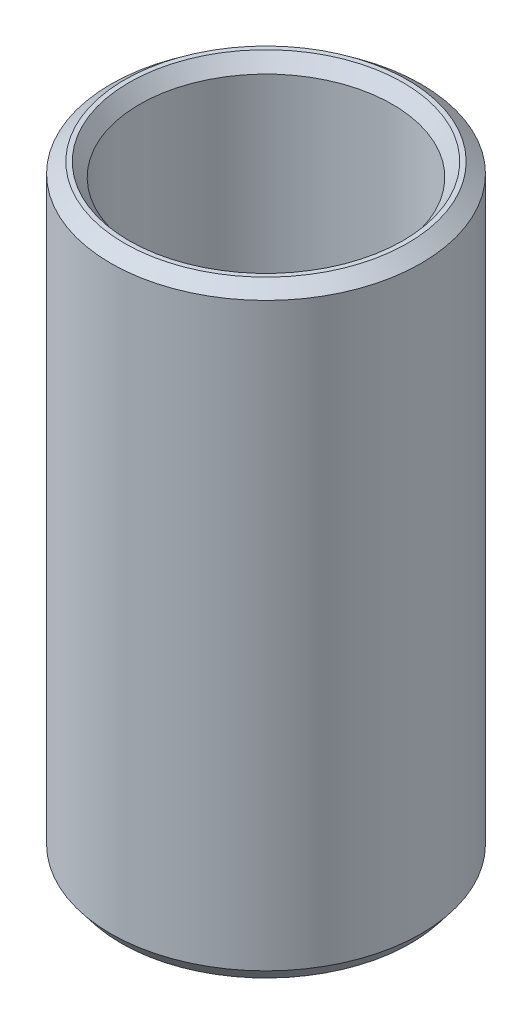
ISO-10303-21;
HEADER;
FILE_DESCRIPTION(('STEP AP214'),'2;1');
FILE_NAME('part.step','',(''),(''),'','','');
FILE_SCHEMA(('AUTOMOTIVE_DESIGN { 1 0 10303 214 1 1 1 1 }'));
ENDSEC;
DATA;
#1=APPLICATION_CONTEXT('core data for automotive mechanical design processes');
#2=APPLICATION_PROTOCOL_DEFINITION('international standard','automotive_design',2000,#1);
#3=PRODUCT_CONTEXT('',#1,'mechanical');
#4=PRODUCT('Part','Part','',(#3));
#5=PRODUCT_RELATED_PRODUCT_CATEGORY('part','',(#4));
#6=PRODUCT_DEFINITION_FORMATION('','',#4);
#7=PRODUCT_DEFINITION_CONTEXT('part definition',#1,'design');
#8=PRODUCT_DEFINITION('design','',#6,#7);
#9=PRODUCT_DEFINITION_SHAPE('','',#8);
#10=(LENGTH_UNIT() NAMED_UNIT(*) SI_UNIT(.MILLI.,.METRE.));
#11=(NAMED_UNIT(*) PLANE_ANGLE_UNIT() SI_UNIT($,.RADIAN.));
#12=(NAMED_UNIT(*) SI_UNIT($,.STERADIAN.) SOLID_ANGLE_UNIT());
#13=UNCERTAINTY_MEASURE_WITH_UNIT(LENGTH_MEASURE(1.E-05),#10,'distance_accuracy_value','');
#14=(GEOMETRIC_REPRESENTATION_CONTEXT(3) GLOBAL_UNCERTAINTY_ASSIGNED_CONTEXT((#13)) GLOBAL_UNIT_ASSIGNED_CONTEXT((#10,
#11,#12)) REPRESENTATION_CONTEXT('',''));
#15=CARTESIAN_POINT('',(0.,0.,0.));
#16=DIRECTION('',(0.,0.,1.));
#17=DIRECTION('',(1.,0.,0.));
#18=AXIS2_PLACEMENT_3D('',#15,#16,#17);
#19=CARTESIAN_POINT('',(0.,175.367665250587,0.));
#20=DIRECTION('',(0.,-1.,0.));
#21=DIRECTION('',(0.,0.,-1.));
#22=AXIS2_PLACEMENT_3D('',#19,#20,#21);
#23=CYLINDRICAL_SURFACE('',#22,45.);
#24=CARTESIAN_POINT('',(0.,3.9515071413356,0.));
#25=DIRECTION('',(0.,1.,0.));
#26=DIRECTION('',(0.,0.,1.));
#27=AXIS2_PLACEMENT_3D('',#24,#25,#26);
#28=CIRCLE('',#27,45.);
#29=CARTESIAN_POINT('',(0.,3.9515071413356,45.));
#30=VERTEX_POINT('',#29);
#31=EDGE_CURVE('E10',#30,#30,#28,.T.);
#32=ORIENTED_EDGE('',*,*,#31,.T.);
#33=EDGE_LOOP('',(#32));
#34=FACE_BOUND('',#33,.T.);
#35=CARTESIAN_POINT('',(0.,172.311264302472,0.));
#36=DIRECTION('',(0.,1.,0.));
#37=DIRECTION('',(0.,0.,1.));
#38=AXIS2_PLACEMENT_3D('',#35,#36,#37);
#39=CIRCLE('',#38,45.);
#40=CARTESIAN_POINT('',(0.,172.311264302472,45.));
#41=VERTEX_POINT('',#40);
#42=EDGE_CURVE('E50',#41,#41,#39,.F.);
#43=ORIENTED_EDGE('',*,*,#42,.T.);
#44=EDGE_LOOP('',(#43));
#45=FACE_BOUND('',#44,.T.);
#46=ADVANCED_FACE('F39',(#34,#45),#23,.T.);
#47=CARTESIAN_POINT('',(0.,175.367665250587,0.));
#48=DIRECTION('',(0.,1.,0.));
#49=DIRECTION('',(0.,0.,1.));
#50=AXIS2_PLACEMENT_3D('',#47,#48,#49);
#51=PLANE('',#50);
#52=CARTESIAN_POINT('',(0.,175.367665250587,0.));
#53=DIRECTION('',(0.,1.,0.));
#54=DIRECTION('',(0.,0.,1.));
#55=AXIS2_PLACEMENT_3D('',#52,#53,#54);
#56=CIRCLE('',#55,39.7259830027873);
#57=CARTESIAN_POINT('',(0.,175.367665250587,39.7259830027873));
#58=VERTEX_POINT('',#57);
#59=EDGE_CURVE('E58',#58,#58,#56,.F.);
#60=ORIENTED_EDGE('',*,*,#59,.T.);
#61=EDGE_LOOP('',(#60));
#62=FACE_BOUND('',#61,.T.);
#63=CARTESIAN_POINT('',(0.,175.367665250587,0.));
#64=DIRECTION('',(0.,1.,0.));
#65=DIRECTION('',(0.,0.,1.));
#66=AXIS2_PLACEMENT_3D('',#63,#64,#65);
#67=CIRCLE('',#66,41.0484928586644);
#68=CARTESIAN_POINT('',(0.,175.367665250587,41.0484928586644));
#69=VERTEX_POINT('',#68);
#70=EDGE_CURVE('E61',#69,#69,#67,.T.);
#71=ORIENTED_EDGE('',*,*,#70,.T.);
#72=EDGE_LOOP('',(#71));
#73=FACE_BOUND('',#72,.T.);
#74=ADVANCED_FACE('F88',(#62,#73),#51,.T.);
#75=CARTESIAN_POINT('',(0.,0.,0.));
#76=DIRECTION('',(0.,1.,0.));
#77=DIRECTION('',(0.,0.,1.));
#78=AXIS2_PLACEMENT_3D('',#75,#76,#77);
#79=PLANE('',#78);
#80=CARTESIAN_POINT('',(0.,0.,0.));
#81=DIRECTION('',(0.,1.,0.));
#82=DIRECTION('',(0.,0.,1.));
#83=AXIS2_PLACEMENT_3D('',#80,#81,#82);
#84=CIRCLE('',#83,40.6210891960075);
#85=CARTESIAN_POINT('',(0.,0.,40.6210891960075));
#86=VERTEX_POINT('',#85);
#87=EDGE_CURVE('E51',#86,#86,#84,.T.);
#88=ORIENTED_EDGE('',*,*,#87,.T.);
#89=EDGE_LOOP('',(#88));
#90=FACE_BOUND('',#89,.T.);
#91=CARTESIAN_POINT('',(0.,0.,0.));
#92=DIRECTION('',(0.,1.,0.));
#93=DIRECTION('',(0.,0.,1.));
#94=AXIS2_PLACEMENT_3D('',#91,#92,#93);
#95=CIRCLE('',#94,41.9435990518846);
#96=CARTESIAN_POINT('',(0.,0.,41.9435990518846));
#97=VERTEX_POINT('',#96);
#98=EDGE_CURVE('E54',#97,#97,#95,.F.);
#99=ORIENTED_EDGE('',*,*,#98,.T.);
#100=EDGE_LOOP('',(#99));
#101=FACE_BOUND('',#100,.T.);
#102=ADVANCED_FACE('F83',(#90,#101),#79,.F.);
#103=CARTESIAN_POINT('',(0.,175.367665250587,0.));
#104=DIRECTION('',(0.,-1.,0.));
#105=DIRECTION('',(0.,0.,-1.));
#106=AXIS2_PLACEMENT_3D('',#103,#104,#105);
#107=CYLINDRICAL_SURFACE('',#106,36.6695820546719);
#108=CARTESIAN_POINT('',(0.,171.416158109252,0.));
#109=DIRECTION('',(0.,1.,0.));
#110=DIRECTION('',(0.,0.,1.));
#111=AXIS2_PLACEMENT_3D('',#108,#109,#110);
#112=CIRCLE('',#111,36.6695820546719);
#113=CARTESIAN_POINT('',(0.,171.416158109252,36.6695820546719));
#114=VERTEX_POINT('',#113);
#115=EDGE_CURVE('E67',#114,#114,#112,.T.);
#116=ORIENTED_EDGE('',*,*,#115,.T.);
#117=EDGE_LOOP('',(#116));
#118=FACE_BOUND('',#117,.T.);
#119=CARTESIAN_POINT('',(0.,3.05640094811538,0.));
#120=DIRECTION('',(0.,1.,0.));
#121=DIRECTION('',(0.,0.,1.));
#122=AXIS2_PLACEMENT_3D('',#119,#120,#121);
#123=CIRCLE('',#122,36.6695820546719);
#124=CARTESIAN_POINT('',(0.,3.05640094811538,36.6695820546719));
#125=VERTEX_POINT('',#124);
#126=EDGE_CURVE('E69',#125,#125,#123,.F.);
#127=ORIENTED_EDGE('',*,*,#126,.T.);
#128=EDGE_LOOP('',(#127));
#129=FACE_BOUND('',#128,.T.);
#130=ADVANCED_FACE('F71',(#118,#129),#107,.F.);
#131=CARTESIAN_POINT('',(0.,171.416158109252,0.));
#132=DIRECTION('',(0.,1.,0.));
#133=DIRECTION('',(0.,0.,1.));
#134=AXIS2_PLACEMENT_3D('',#131,#132,#133);
#135=CONICAL_SURFACE('',#134,36.6695820546719,0.658358030805076);
#136=ORIENTED_EDGE('',*,*,#59,.F.);
#137=EDGE_LOOP('',(#136));
#138=FACE_BOUND('',#137,.T.);
#139=ORIENTED_EDGE('',*,*,#115,.F.);
#140=EDGE_LOOP('',(#139));
#141=FACE_BOUND('',#140,.T.);
#142=ADVANCED_FACE('F77',(#138,#141),#135,.F.);
#143=CARTESIAN_POINT('',(0.,0.,0.));
#144=DIRECTION('',(0.,-1.,0.));
#145=DIRECTION('',(0.,0.,-1.));
#146=AXIS2_PLACEMENT_3D('',#143,#144,#145);
#147=CONICAL_SURFACE('',#146,40.6210891960075,0.912438295989816);
#148=ORIENTED_EDGE('',*,*,#126,.F.);
#149=EDGE_LOOP('',(#148));
#150=FACE_BOUND('',#149,.T.);
#151=ORIENTED_EDGE('',*,*,#87,.F.);
#152=EDGE_LOOP('',(#151));
#153=FACE_BOUND('',#152,.T.);
#154=ADVANCED_FACE('F73',(#150,#153),#147,.F.);
#155=CARTESIAN_POINT('',(0.,3.9515071413356,0.));
#156=DIRECTION('',(0.,1.,0.));
#157=DIRECTION('',(0.,0.,1.));
#158=AXIS2_PLACEMENT_3D('',#155,#156,#157);
#159=CONICAL_SURFACE('',#158,45.,0.658358030805083);
#160=ORIENTED_EDGE('',*,*,#98,.F.);
#161=EDGE_LOOP('',(#160));
#162=FACE_BOUND('',#161,.T.);
#163=ORIENTED_EDGE('',*,*,#31,.F.);
#164=EDGE_LOOP('',(#163));
#165=FACE_BOUND('',#164,.T.);
#166=ADVANCED_FACE('F76',(#162,#165),#159,.T.);
#167=CARTESIAN_POINT('',(0.,175.367665250587,0.));
#168=DIRECTION('',(0.,-1.,0.));
#169=DIRECTION('',(0.,0.,-1.));
#170=AXIS2_PLACEMENT_3D('',#167,#168,#169);
#171=CONICAL_SURFACE('',#170,41.0484928586644,0.912438295989816);
#172=ORIENTED_EDGE('',*,*,#42,.F.);
#173=EDGE_LOOP('',(#172));
#174=FACE_BOUND('',#173,.T.);
#175=ORIENTED_EDGE('',*,*,#70,.F.);
#176=EDGE_LOOP('',(#175));
#177=FACE_BOUND('',#176,.T.);
#178=ADVANCED_FACE('F45',(#174,#177),#171,.T.);
#179=CLOSED_SHELL('',(#46,#74,#102,#130,#142,#154,#166,#178));
#180=MANIFOLD_SOLID_BREP('B2',#179);
#181=ADVANCED_BREP_SHAPE_REPRESENTATION('',(#18,#180),#14);
#182=SHAPE_DEFINITION_REPRESENTATION(#9,#181);
ENDSEC;
END-ISO-10303-21;
